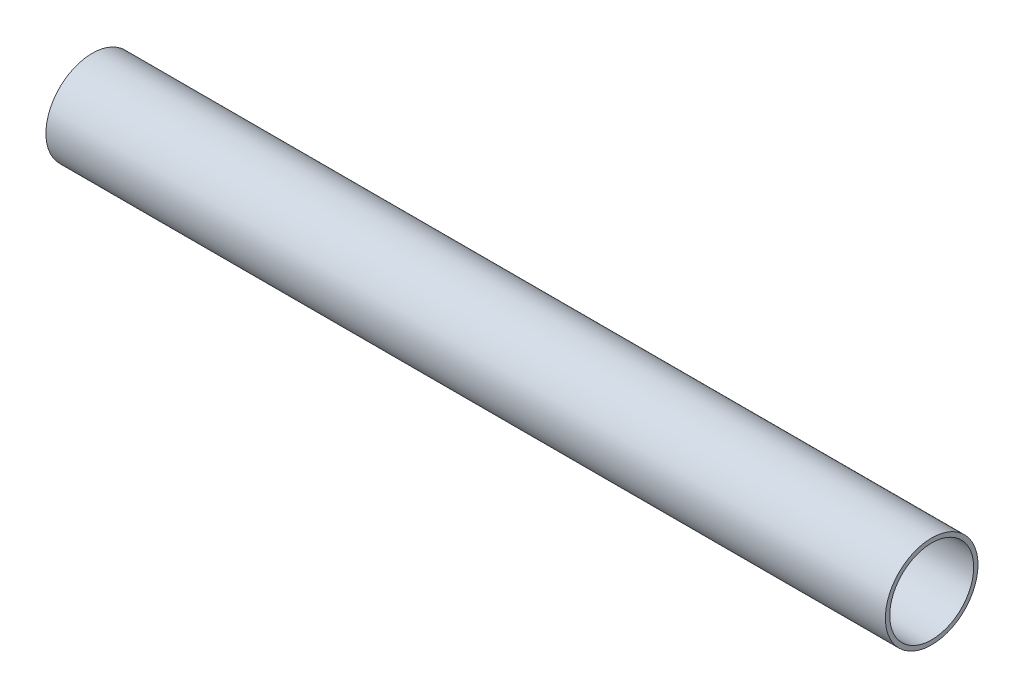
ISO-10303-21;
HEADER;
FILE_DESCRIPTION(('STEP AP214'),'2;1');
FILE_NAME('part.step','',(''),(''),'','','');
FILE_SCHEMA(('AUTOMOTIVE_DESIGN { 1 0 10303 214 1 1 1 1 }'));
ENDSEC;
DATA;
#1=APPLICATION_CONTEXT('core data for automotive mechanical design processes');
#2=APPLICATION_PROTOCOL_DEFINITION('international standard','automotive_design',2000,#1);
#3=PRODUCT_CONTEXT('',#1,'mechanical');
#4=PRODUCT('Part','Part','',(#3));
#5=PRODUCT_RELATED_PRODUCT_CATEGORY('part','',(#4));
#6=PRODUCT_DEFINITION_FORMATION('','',#4);
#7=PRODUCT_DEFINITION_CONTEXT('part definition',#1,'design');
#8=PRODUCT_DEFINITION('design','',#6,#7);
#9=PRODUCT_DEFINITION_SHAPE('','',#8);
#10=(LENGTH_UNIT() NAMED_UNIT(*) SI_UNIT(.MILLI.,.METRE.));
#11=(NAMED_UNIT(*) PLANE_ANGLE_UNIT() SI_UNIT($,.RADIAN.));
#12=(NAMED_UNIT(*) SI_UNIT($,.STERADIAN.) SOLID_ANGLE_UNIT());
#13=UNCERTAINTY_MEASURE_WITH_UNIT(LENGTH_MEASURE(1.E-05),#10,'distance_accuracy_value','');
#14=(GEOMETRIC_REPRESENTATION_CONTEXT(3) GLOBAL_UNCERTAINTY_ASSIGNED_CONTEXT((#13)) GLOBAL_UNIT_ASSIGNED_CONTEXT((#10,
#11,#12)) REPRESENTATION_CONTEXT('',''));
#15=CARTESIAN_POINT('',(0.,0.,0.));
#16=DIRECTION('',(0.,0.,1.));
#17=DIRECTION('',(1.,0.,0.));
#18=AXIS2_PLACEMENT_3D('',#15,#16,#17);
#19=CARTESIAN_POINT('',(0.,0.,0.));
#20=DIRECTION('',(1.,0.,0.));
#21=DIRECTION('',(0.,0.,-1.));
#22=AXIS2_PLACEMENT_3D('',#19,#20,#21);
#23=CYLINDRICAL_SURFACE('',#22,8.);
#24=CARTESIAN_POINT('',(0.,0.,0.));
#25=DIRECTION('',(1.,0.,0.));
#26=DIRECTION('',(0.,0.,-1.));
#27=AXIS2_PLACEMENT_3D('',#24,#25,#26);
#28=CIRCLE('',#27,8.);
#29=CARTESIAN_POINT('',(0.,0.,-8.));
#30=VERTEX_POINT('',#29);
#31=EDGE_CURVE('E10',#30,#30,#28,.T.);
#32=ORIENTED_EDGE('',*,*,#31,.T.);
#33=EDGE_LOOP('',(#32));
#34=FACE_BOUND('',#33,.T.);
#35=CARTESIAN_POINT('',(145.,0.,0.));
#36=DIRECTION('',(1.,0.,0.));
#37=DIRECTION('',(0.,0.,-1.));
#38=AXIS2_PLACEMENT_3D('',#35,#36,#37);
#39=CIRCLE('',#38,8.);
#40=CARTESIAN_POINT('',(145.,0.,-8.));
#41=VERTEX_POINT('',#40);
#42=EDGE_CURVE('E45',#41,#41,#39,.T.);
#43=ORIENTED_EDGE('',*,*,#42,.F.);
#44=EDGE_LOOP('',(#43));
#45=FACE_BOUND('',#44,.T.);
#46=ADVANCED_FACE('F31',(#34,#45),#23,.T.);
#47=CARTESIAN_POINT('',(0.,8.,0.));
#48=DIRECTION('',(-1.,0.,0.));
#49=DIRECTION('',(0.,0.,1.));
#50=AXIS2_PLACEMENT_3D('',#47,#48,#49);
#51=PLANE('',#50);
#52=CARTESIAN_POINT('',(0.,0.,0.));
#53=DIRECTION('',(1.,0.,0.));
#54=DIRECTION('',(0.,0.,-1.));
#55=AXIS2_PLACEMENT_3D('',#52,#53,#54);
#56=CIRCLE('',#55,7.25);
#57=CARTESIAN_POINT('',(0.,0.,-7.25));
#58=VERTEX_POINT('',#57);
#59=EDGE_CURVE('E37',#58,#58,#56,.T.);
#60=ORIENTED_EDGE('',*,*,#59,.T.);
#61=EDGE_LOOP('',(#60));
#62=FACE_BOUND('',#61,.T.);
#63=ORIENTED_EDGE('',*,*,#31,.F.);
#64=EDGE_LOOP('',(#63));
#65=FACE_BOUND('',#64,.T.);
#66=ADVANCED_FACE('F55',(#62,#65),#51,.T.);
#67=CARTESIAN_POINT('',(0.,0.,0.));
#68=DIRECTION('',(1.,0.,0.));
#69=DIRECTION('',(0.,0.,-1.));
#70=AXIS2_PLACEMENT_3D('',#67,#68,#69);
#71=CYLINDRICAL_SURFACE('',#70,7.25);
#72=CARTESIAN_POINT('',(145.,0.,0.));
#73=DIRECTION('',(1.,0.,0.));
#74=DIRECTION('',(0.,0.,-1.));
#75=AXIS2_PLACEMENT_3D('',#72,#73,#74);
#76=CIRCLE('',#75,7.25);
#77=CARTESIAN_POINT('',(145.,0.,-7.25));
#78=VERTEX_POINT('',#77);
#79=EDGE_CURVE('E41',#78,#78,#76,.T.);
#80=ORIENTED_EDGE('',*,*,#79,.T.);
#81=EDGE_LOOP('',(#80));
#82=FACE_BOUND('',#81,.T.);
#83=ORIENTED_EDGE('',*,*,#59,.F.);
#84=EDGE_LOOP('',(#83));
#85=FACE_BOUND('',#84,.T.);
#86=ADVANCED_FACE('F59',(#82,#85),#71,.F.);
#87=CARTESIAN_POINT('',(145.,7.25,0.));
#88=DIRECTION('',(1.,0.,0.));
#89=DIRECTION('',(0.,0.,-1.));
#90=AXIS2_PLACEMENT_3D('',#87,#88,#89);
#91=PLANE('',#90);
#92=ORIENTED_EDGE('',*,*,#42,.T.);
#93=EDGE_LOOP('',(#92));
#94=FACE_BOUND('',#93,.T.);
#95=ORIENTED_EDGE('',*,*,#79,.F.);
#96=EDGE_LOOP('',(#95));
#97=FACE_BOUND('',#96,.T.);
#98=ADVANCED_FACE('F51',(#94,#97),#91,.T.);
#99=CLOSED_SHELL('',(#46,#66,#86,#98));
#100=MANIFOLD_SOLID_BREP('B2',#99);
#101=ADVANCED_BREP_SHAPE_REPRESENTATION('',(#18,#100),#14);
#102=SHAPE_DEFINITION_REPRESENTATION(#9,#101);
ENDSEC;
END-ISO-10303-21;
